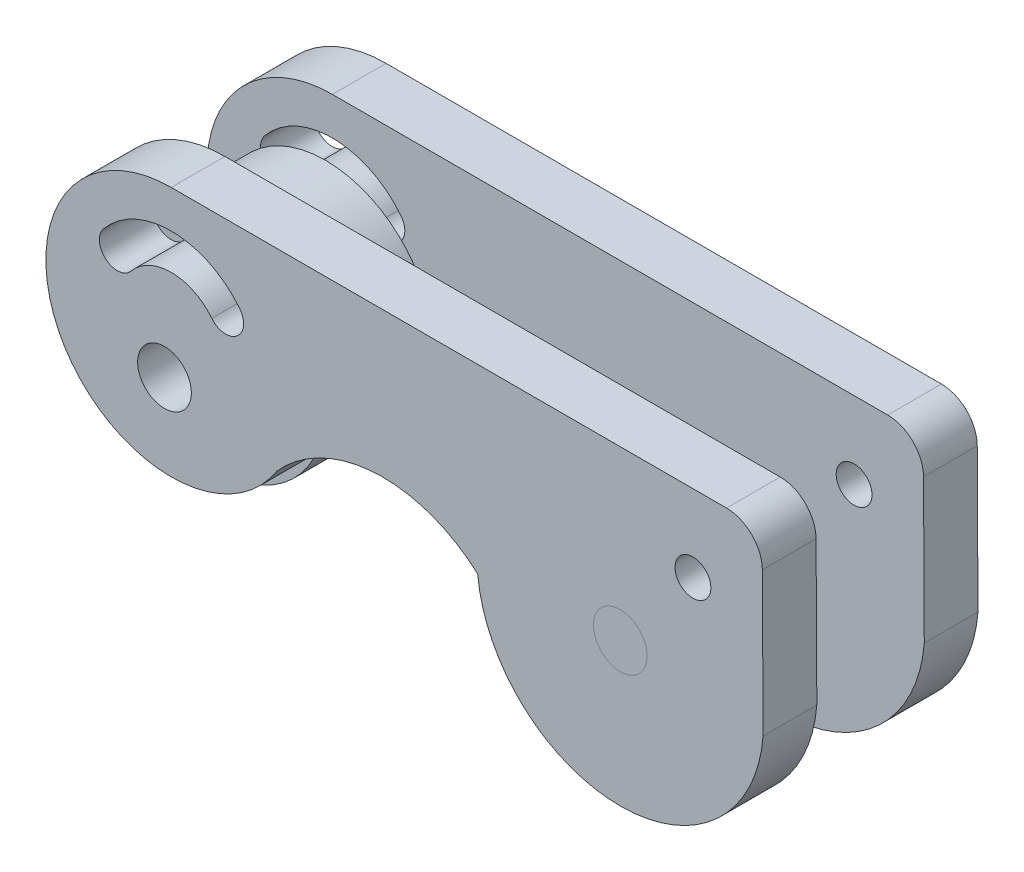
ISO-10303-21;
HEADER;
FILE_DESCRIPTION(('STEP AP214'),'2;1');
FILE_NAME('part.step','',(''),(''),'','','');
FILE_SCHEMA(('AUTOMOTIVE_DESIGN { 1 0 10303 214 1 1 1 1 }'));
ENDSEC;
DATA;
#1=APPLICATION_CONTEXT('core data for automotive mechanical design processes');
#2=APPLICATION_PROTOCOL_DEFINITION('international standard','automotive_design',2000,#1);
#3=PRODUCT_CONTEXT('',#1,'mechanical');
#4=PRODUCT('Part','Part','',(#3));
#5=PRODUCT_RELATED_PRODUCT_CATEGORY('part','',(#4));
#6=PRODUCT_DEFINITION_FORMATION('','',#4);
#7=PRODUCT_DEFINITION_CONTEXT('part definition',#1,'design');
#8=PRODUCT_DEFINITION('design','',#6,#7);
#9=PRODUCT_DEFINITION_SHAPE('','',#8);
#10=(LENGTH_UNIT() NAMED_UNIT(*) SI_UNIT(.MILLI.,.METRE.));
#11=(NAMED_UNIT(*) PLANE_ANGLE_UNIT() SI_UNIT($,.RADIAN.));
#12=(NAMED_UNIT(*) SI_UNIT($,.STERADIAN.) SOLID_ANGLE_UNIT());
#13=UNCERTAINTY_MEASURE_WITH_UNIT(LENGTH_MEASURE(1.E-05),#10,'distance_accuracy_value','');
#14=(GEOMETRIC_REPRESENTATION_CONTEXT(3) GLOBAL_UNCERTAINTY_ASSIGNED_CONTEXT((#13)) GLOBAL_UNIT_ASSIGNED_CONTEXT((#10,
#11,#12)) REPRESENTATION_CONTEXT('',''));
#15=CARTESIAN_POINT('',(0.,0.,0.));
#16=DIRECTION('',(0.,0.,1.));
#17=DIRECTION('',(1.,0.,0.));
#18=AXIS2_PLACEMENT_3D('',#15,#16,#17);
#19=CARTESIAN_POINT('',(8.75431331325364,33.2026229633381,-19.7857344309896));
#20=DIRECTION('',(0.,0.,-1.));
#21=DIRECTION('',(-1.,0.,0.));
#22=AXIS2_PLACEMENT_3D('',#19,#20,#21);
#23=CYLINDRICAL_SURFACE('',#22,1.5);
#24=CARTESIAN_POINT('',(8.75431331325364,33.2026229633381,-19.7857344309896));
#25=DIRECTION('',(0.,0.,1.));
#26=DIRECTION('',(1.,0.,0.));
#27=AXIS2_PLACEMENT_3D('',#24,#25,#26);
#28=CIRCLE('',#27,1.5);
#29=CARTESIAN_POINT('',(10.2543133132536,33.2026229633381,-19.7857344309896));
#30=VERTEX_POINT('',#29);
#31=EDGE_CURVE('P0_E10',#30,#30,#28,.T.);
#32=ORIENTED_EDGE('',*,*,#31,.F.);
#33=EDGE_LOOP('',(#32));
#34=FACE_BOUND('',#33,.T.);
#35=CARTESIAN_POINT('',(8.75431331325364,33.2026229633381,-31.7857344309896));
#36=DIRECTION('',(0.,0.,1.));
#37=DIRECTION('',(1.,0.,0.));
#38=AXIS2_PLACEMENT_3D('',#35,#36,#37);
#39=CIRCLE('',#38,1.5);
#40=CARTESIAN_POINT('',(10.2543133132536,33.2026229633381,-31.7857344309896));
#41=VERTEX_POINT('',#40);
#42=EDGE_CURVE('P0_E18',#41,#41,#39,.T.);
#43=ORIENTED_EDGE('',*,*,#42,.T.);
#44=EDGE_LOOP('',(#43));
#45=FACE_BOUND('',#44,.T.);
#46=ADVANCED_FACE('P0_F15',(#34,#45),#23,.T.);
#47=CARTESIAN_POINT('',(8.75431331325364,33.2026229633381,-19.7857344309896));
#48=DIRECTION('',(0.,0.,1.));
#49=DIRECTION('',(1.,0.,0.));
#50=AXIS2_PLACEMENT_3D('',#47,#48,#49);
#51=PLANE('',#50);
#52=ORIENTED_EDGE('',*,*,#31,.T.);
#53=EDGE_LOOP('',(#52));
#54=FACE_BOUND('',#53,.T.);
#55=ADVANCED_FACE('P0_F30',(#54),#51,.T.);
#56=CARTESIAN_POINT('',(8.75431331325364,33.2026229633381,-31.7857344309896));
#57=DIRECTION('',(0.,0.,1.));
#58=DIRECTION('',(1.,0.,0.));
#59=AXIS2_PLACEMENT_3D('',#56,#57,#58);
#60=PLANE('',#59);
#61=ORIENTED_EDGE('',*,*,#42,.F.);
#62=EDGE_LOOP('',(#61));
#63=FACE_BOUND('',#62,.T.);
#64=ADVANCED_FACE('P0_F28',(#63),#60,.F.);
#65=CLOSED_SHELL('',(#46,#55,#64));
#66=MANIFOLD_SOLID_BREP('P0_B1',#65);
#67=CARTESIAN_POINT('',(-16.6985633335867,33.2026229633381,-22.7857344309896));
#68=DIRECTION('',(0.,0.,1.));
#69=DIRECTION('',(-0.517788977415882,0.855508372177979,0.));
#70=AXIS2_PLACEMENT_3D('',#67,#68,#69);
#71=PLANE('',#70);
#72=CARTESIAN_POINT('',(-16.6985633335867,33.2026229633381,-22.7857344309896));
#73=DIRECTION('',(0.,0.,1.));
#74=DIRECTION('',(-0.517788977415882,0.855508372177979,0.));
#75=AXIS2_PLACEMENT_3D('',#72,#73,#74);
#76=CIRCLE('',#75,6.);
#77=CARTESIAN_POINT('',(-19.805297198082,38.335673196406,-22.7857344309896));
#78=VERTEX_POINT('',#77);
#79=EDGE_CURVE('P1_E9',#78,#78,#76,.T.);
#80=ORIENTED_EDGE('',*,*,#79,.T.);
#81=EDGE_LOOP('',(#80));
#82=FACE_BOUND('',#81,.T.);
#83=CARTESIAN_POINT('',(-16.6985633335867,33.2026229633381,-22.7857344309896));
#84=DIRECTION('',(0.,0.,1.));
#85=DIRECTION('',(-0.517788977415882,0.855508372177979,0.));
#86=AXIS2_PLACEMENT_3D('',#83,#84,#85);
#87=CIRCLE('',#86,1.5);
#88=CARTESIAN_POINT('',(-17.4752467997105,34.485885521605,-22.7857344309896));
#89=VERTEX_POINT('',#88);
#90=EDGE_CURVE('P1_E25',#89,#89,#87,.T.);
#91=ORIENTED_EDGE('',*,*,#90,.F.);
#92=EDGE_LOOP('',(#91));
#93=FACE_BOUND('',#92,.T.);
#94=ADVANCED_FACE('P1_F14',(#82,#93),#71,.T.);
#95=CARTESIAN_POINT('',(-16.6985633335867,33.2026229633381,-28.7857344309896));
#96=DIRECTION('',(0.,0.,1.));
#97=DIRECTION('',(-0.517788977415882,0.855508372177979,0.));
#98=AXIS2_PLACEMENT_3D('',#95,#96,#97);
#99=PLANE('',#98);
#100=CARTESIAN_POINT('',(-16.6985633335867,33.2026229633381,-28.7857344309896));
#101=DIRECTION('',(0.,0.,1.));
#102=DIRECTION('',(-0.517788977415882,0.855508372177979,0.));
#103=AXIS2_PLACEMENT_3D('',#100,#101,#102);
#104=CIRCLE('',#103,6.);
#105=CARTESIAN_POINT('',(-19.805297198082,38.335673196406,-28.7857344309896));
#106=VERTEX_POINT('',#105);
#107=EDGE_CURVE('P1_E18',#106,#106,#104,.T.);
#108=ORIENTED_EDGE('',*,*,#107,.F.);
#109=EDGE_LOOP('',(#108));
#110=FACE_BOUND('',#109,.T.);
#111=CARTESIAN_POINT('',(-16.6985633335867,33.2026229633381,-28.7857344309896));
#112=DIRECTION('',(0.,0.,1.));
#113=DIRECTION('',(-0.517788977415882,0.855508372177979,0.));
#114=AXIS2_PLACEMENT_3D('',#111,#112,#113);
#115=CIRCLE('',#114,1.5);
#116=CARTESIAN_POINT('',(-17.4752467997105,34.485885521605,-28.7857344309896));
#117=VERTEX_POINT('',#116);
#118=EDGE_CURVE('P1_E27',#117,#117,#115,.T.);
#119=ORIENTED_EDGE('',*,*,#118,.T.);
#120=EDGE_LOOP('',(#119));
#121=FACE_BOUND('',#120,.T.);
#122=ADVANCED_FACE('P1_F37',(#110,#121),#99,.F.);
#123=CARTESIAN_POINT('',(-16.6985633335867,33.2026229633381,-22.7857344309896));
#124=DIRECTION('',(0.,0.,-1.));
#125=DIRECTION('',(0.517788977415882,-0.855508372177979,0.));
#126=AXIS2_PLACEMENT_3D('',#123,#124,#125);
#127=CYLINDRICAL_SURFACE('',#126,6.);
#128=ORIENTED_EDGE('',*,*,#79,.F.);
#129=EDGE_LOOP('',(#128));
#130=FACE_BOUND('',#129,.T.);
#131=ORIENTED_EDGE('',*,*,#107,.T.);
#132=EDGE_LOOP('',(#131));
#133=FACE_BOUND('',#132,.T.);
#134=ADVANCED_FACE('P1_F16',(#130,#133),#127,.T.);
#135=CARTESIAN_POINT('',(-16.6985633335867,33.2026229633381,-22.7857344309896));
#136=DIRECTION('',(0.,0.,-1.));
#137=DIRECTION('',(0.517788977415882,-0.855508372177979,0.));
#138=AXIS2_PLACEMENT_3D('',#135,#136,#137);
#139=CYLINDRICAL_SURFACE('',#138,1.5);
#140=ORIENTED_EDGE('',*,*,#90,.T.);
#141=EDGE_LOOP('',(#140));
#142=FACE_BOUND('',#141,.T.);
#143=ORIENTED_EDGE('',*,*,#118,.F.);
#144=EDGE_LOOP('',(#143));
#145=FACE_BOUND('',#144,.T.);
#146=ADVANCED_FACE('P1_F33',(#142,#145),#139,.F.);
#147=CLOSED_SHELL('',(#94,#122,#134,#146));
#148=MANIFOLD_SOLID_BREP('P1_B1',#147);
#149=CARTESIAN_POINT('',(-16.3228165615196,35.5800352096352,-19.7857344309896));
#150=DIRECTION('',(0.,0.,1.));
#151=DIRECTION('',(1.,0.,0.));
#152=AXIS2_PLACEMENT_3D('',#149,#150,#151);
#153=PLANE('',#152);
#154=CARTESIAN_POINT('',(12.8113036584747,38.2810901867022,-19.7857344309896));
#155=DIRECTION('',(0.,0.,1.));
#156=DIRECTION('',(1.,0.,0.));
#157=AXIS2_PLACEMENT_3D('',#154,#155,#156);
#158=CIRCLE('',#157,1.);
#159=CARTESIAN_POINT('',(13.8113036584747,38.2810901867022,-19.7857344309896));
#160=VERTEX_POINT('',#159);
#161=EDGE_CURVE('P2_E123',#160,#160,#158,.T.);
#162=ORIENTED_EDGE('',*,*,#161,.F.);
#163=EDGE_LOOP('',(#162));
#164=FACE_BOUND('',#163,.T.);
#165=CARTESIAN_POINT('',(-16.3228165615196,35.5800352096352,-19.7857344309896));
#166=DIRECTION('',(0.,0.,1.));
#167=DIRECTION('',(1.,0.,0.));
#168=AXIS2_PLACEMENT_3D('',#165,#166,#167);
#169=CIRCLE('',#168,7.);
#170=CARTESIAN_POINT('',(-16.3228165615196,42.5800352096351,-19.7857344309896));
#171=VERTEX_POINT('',#170);
#172=CARTESIAN_POINT('',(-10.4277419329652,31.8053703074518,-19.7857344309896));
#173=VERTEX_POINT('',#172);
#174=EDGE_CURVE('P2_E139',#171,#173,#169,.T.);
#175=ORIENTED_EDGE('',*,*,#174,.T.);
#176=CARTESIAN_POINT('',(-4.50272099498319,26.5800352096352,-19.7857344309896));
#177=DIRECTION('',(0.,0.,-1.));
#178=DIRECTION('',(-1.,0.,0.));
#179=AXIS2_PLACEMENT_3D('',#176,#177,#178);
#180=CIRCLE('',#179,7.9);
#181=CARTESIAN_POINT('',(0.790300162154489,32.4446687898423,-19.7857344309896));
#182=VERTEX_POINT('',#181);
#183=EDGE_CURVE('P2_E142',#173,#182,#180,.T.);
#184=ORIENTED_EDGE('',*,*,#183,.T.);
#185=CARTESIAN_POINT('',(8.75431331325364,33.2026229633381,-19.7857344309896));
#186=DIRECTION('',(0.,0.,1.));
#187=DIRECTION('',(1.,0.,0.));
#188=AXIS2_PLACEMENT_3D('',#185,#186,#187);
#189=CIRCLE('',#188,8.);
#190=CARTESIAN_POINT('',(16.7297550170837,32.5762607448033,-19.7857344309896));
#191=VERTEX_POINT('',#190);
#192=EDGE_CURVE('P2_E145',#182,#191,#189,.T.);
#193=ORIENTED_EDGE('',*,*,#192,.T.);
#194=DIRECTION('',(-0.00525510174907032,0.999986191857471,0.));
#195=VECTOR('',#194,1.);
#196=CARTESIAN_POINT('',(16.7297550170837,32.5762607448033,-19.7857344309896));
#197=LINE('',#196,#195);
#198=CARTESIAN_POINT('',(16.6876385541555,40.5905454131333,-19.7857344309896));
#199=VERTEX_POINT('',#198);
#200=EDGE_CURVE('P2_E147',#191,#199,#197,.T.);
#201=ORIENTED_EDGE('',*,*,#200,.T.);
#202=CARTESIAN_POINT('',(14.6876661704406,40.5800352096351,-19.7857344309896));
#203=DIRECTION('',(0.,0.,1.));
#204=DIRECTION('',(-1.,0.,0.));
#205=AXIS2_PLACEMENT_3D('',#202,#203,#204);
#206=CIRCLE('',#205,2.);
#207=CARTESIAN_POINT('',(14.6876661704406,42.5800352096351,-19.7857344309896));
#208=VERTEX_POINT('',#207);
#209=EDGE_CURVE('P2_E149',#199,#208,#206,.T.);
#210=ORIENTED_EDGE('',*,*,#209,.T.);
#211=DIRECTION('',(-1.,0.,0.));
#212=VECTOR('',#211,1.);
#213=CARTESIAN_POINT('',(-16.3228165615196,42.5800352096351,-19.7857344309896));
#214=LINE('',#213,#212);
#215=EDGE_CURVE('P2_E151',#208,#171,#214,.T.);
#216=ORIENTED_EDGE('',*,*,#215,.T.);
#217=EDGE_LOOP('',(#175,#184,#193,#201,#210,#216));
#218=FACE_BOUND('',#217,.T.);
#219=CARTESIAN_POINT('',(8.75431331325364,33.2026229633381,-19.7857344309896));
#220=DIRECTION('',(0.,0.,1.));
#221=DIRECTION('',(1.,0.,0.));
#222=AXIS2_PLACEMENT_3D('',#219,#220,#221);
#223=CIRCLE('',#222,1.5);
#224=CARTESIAN_POINT('',(10.2543133132536,33.2026229633381,-19.7857344309896));
#225=VERTEX_POINT('',#224);
#226=EDGE_CURVE('P2_E133',#225,#225,#223,.T.);
#227=ORIENTED_EDGE('',*,*,#226,.F.);
#228=EDGE_LOOP('',(#227));
#229=FACE_BOUND('',#228,.T.);
#230=CARTESIAN_POINT('',(-16.3228165615196,35.5800352096352,-19.7857344309896));
#231=DIRECTION('',(0.,0.,1.));
#232=DIRECTION('',(1.,0.,0.));
#233=AXIS2_PLACEMENT_3D('',#230,#231,#232);
#234=CIRCLE('',#233,4.89513860802206);
#235=CARTESIAN_POINT('',(-12.4977183373552,38.6347046790284,-19.7857344309896));
#236=VERTEX_POINT('',#235);
#237=CARTESIAN_POINT('',(-20.1062034121941,38.6862170990118,-19.7857344309896));
#238=VERTEX_POINT('',#237);
#239=EDGE_CURVE('P2_E102',#236,#238,#234,.T.);
#240=ORIENTED_EDGE('',*,*,#239,.F.);
#241=CARTESIAN_POINT('',(-13.2791258786853,38.0106836422415,-19.7857344309896));
#242=DIRECTION('',(0.,0.,1.));
#243=DIRECTION('',(-1.,0.,0.));
#244=AXIS2_PLACEMENT_3D('',#241,#242,#243);
#245=CIRCLE('',#244,0.999999999999999);
#246=CARTESIAN_POINT('',(-14.0605334200153,37.3866626054547,-19.7857344309896));
#247=VERTEX_POINT('',#246);
#248=EDGE_CURVE('P2_E94',#247,#236,#245,.T.);
#249=ORIENTED_EDGE('',*,*,#248,.F.);
#250=CARTESIAN_POINT('',(-16.3228165615196,35.5800352096352,-19.7857344309896));
#251=DIRECTION('',(0.,0.,-1.));
#252=DIRECTION('',(1.,0.,0.));
#253=AXIS2_PLACEMENT_3D('',#250,#251,#252);
#254=CIRCLE('',#253,2.89513860802206);
#255=CARTESIAN_POINT('',(-18.5604302876193,37.417128667364,-19.7857344309896));
#256=VERTEX_POINT('',#255);
#257=EDGE_CURVE('P2_E117',#256,#247,#254,.T.);
#258=ORIENTED_EDGE('',*,*,#257,.F.);
#259=CARTESIAN_POINT('',(-19.3333168499067,38.0516728831879,-19.7857344309896));
#260=DIRECTION('',(0.,0.,1.));
#261=DIRECTION('',(1.,0.,0.));
#262=AXIS2_PLACEMENT_3D('',#259,#260,#261);
#263=CIRCLE('',#262,1.);
#264=EDGE_CURVE('P2_E115',#238,#256,#263,.T.);
#265=ORIENTED_EDGE('',*,*,#264,.F.);
#266=EDGE_LOOP('',(#240,#249,#258,#265));
#267=FACE_BOUND('',#266,.T.);
#268=CARTESIAN_POINT('',(-16.6985633335867,33.2026229633381,-19.7857344309896));
#269=DIRECTION('',(0.,0.,1.));
#270=DIRECTION('',(1.,0.,0.));
#271=AXIS2_PLACEMENT_3D('',#268,#269,#270);
#272=CIRCLE('',#271,1.5);
#273=CARTESIAN_POINT('',(-15.1985633335867,33.2026229633381,-19.7857344309896));
#274=VERTEX_POINT('',#273);
#275=EDGE_CURVE('P2_E252',#274,#274,#272,.T.);
#276=ORIENTED_EDGE('',*,*,#275,.F.);
#277=EDGE_LOOP('',(#276));
#278=FACE_BOUND('',#277,.T.);
#279=ADVANCED_FACE('P2_F17',(#164,#218,#229,#267,#278),#153,.T.);
#280=CARTESIAN_POINT('',(-16.3228165615196,35.5800352096352,-22.7857344309896));
#281=DIRECTION('',(0.,0.,1.));
#282=DIRECTION('',(1.,0.,0.));
#283=AXIS2_PLACEMENT_3D('',#280,#281,#282);
#284=PLANE('',#283);
#285=CARTESIAN_POINT('',(8.75431331325364,33.2026229633381,-22.7857344309896));
#286=DIRECTION('',(0.,0.,1.));
#287=DIRECTION('',(1.,0.,0.));
#288=AXIS2_PLACEMENT_3D('',#285,#286,#287);
#289=CIRCLE('',#288,1.5);
#290=CARTESIAN_POINT('',(10.2543133132536,33.2026229633381,-22.7857344309896));
#291=VERTEX_POINT('',#290);
#292=EDGE_CURVE('P2_E110',#291,#291,#289,.T.);
#293=ORIENTED_EDGE('',*,*,#292,.T.);
#294=EDGE_LOOP('',(#293));
#295=FACE_BOUND('',#294,.T.);
#296=CARTESIAN_POINT('',(-16.3228165615196,35.5800352096352,-22.7857344309896));
#297=DIRECTION('',(0.,0.,1.));
#298=DIRECTION('',(1.,0.,0.));
#299=AXIS2_PLACEMENT_3D('',#296,#297,#298);
#300=CIRCLE('',#299,7.);
#301=CARTESIAN_POINT('',(-16.3228165615196,42.5800352096351,-22.7857344309896));
#302=VERTEX_POINT('',#301);
#303=CARTESIAN_POINT('',(-10.4277419329652,31.8053703074518,-22.7857344309896));
#304=VERTEX_POINT('',#303);
#305=EDGE_CURVE('P2_E136',#302,#304,#300,.T.);
#306=ORIENTED_EDGE('',*,*,#305,.F.);
#307=DIRECTION('',(-1.,0.,0.));
#308=VECTOR('',#307,1.);
#309=CARTESIAN_POINT('',(-16.3228165615196,42.5800352096351,-22.7857344309896));
#310=LINE('',#309,#308);
#311=CARTESIAN_POINT('',(14.6876661704406,42.5800352096351,-22.7857344309896));
#312=VERTEX_POINT('',#311);
#313=EDGE_CURVE('P2_E143',#312,#302,#310,.T.);
#314=ORIENTED_EDGE('',*,*,#313,.F.);
#315=CARTESIAN_POINT('',(14.6876661704406,40.5800352096351,-22.7857344309896));
#316=DIRECTION('',(0.,0.,1.));
#317=DIRECTION('',(-1.,0.,0.));
#318=AXIS2_PLACEMENT_3D('',#315,#316,#317);
#319=CIRCLE('',#318,2.);
#320=CARTESIAN_POINT('',(16.6876385541555,40.5905454131333,-22.7857344309896));
#321=VERTEX_POINT('',#320);
#322=EDGE_CURVE('P2_E162',#321,#312,#319,.T.);
#323=ORIENTED_EDGE('',*,*,#322,.F.);
#324=DIRECTION('',(-0.00525510174907032,0.999986191857471,0.));
#325=VECTOR('',#324,1.);
#326=CARTESIAN_POINT('',(16.7297550170837,32.5762607448033,-22.7857344309896));
#327=LINE('',#326,#325);
#328=CARTESIAN_POINT('',(16.7297550170837,32.5762607448033,-22.7857344309896));
#329=VERTEX_POINT('',#328);
#330=EDGE_CURVE('P2_E160',#329,#321,#327,.T.);
#331=ORIENTED_EDGE('',*,*,#330,.F.);
#332=CARTESIAN_POINT('',(8.75431331325364,33.2026229633381,-22.7857344309896));
#333=DIRECTION('',(0.,0.,1.));
#334=DIRECTION('',(1.,0.,0.));
#335=AXIS2_PLACEMENT_3D('',#332,#333,#334);
#336=CIRCLE('',#335,8.);
#337=CARTESIAN_POINT('',(0.790300162154489,32.4446687898423,-22.7857344309896));
#338=VERTEX_POINT('',#337);
#339=EDGE_CURVE('P2_E158',#338,#329,#336,.T.);
#340=ORIENTED_EDGE('',*,*,#339,.F.);
#341=CARTESIAN_POINT('',(-4.50272099498319,26.5800352096352,-22.7857344309896));
#342=DIRECTION('',(0.,0.,-1.));
#343=DIRECTION('',(-1.,0.,0.));
#344=AXIS2_PLACEMENT_3D('',#341,#342,#343);
#345=CIRCLE('',#344,7.9);
#346=EDGE_CURVE('P2_E156',#304,#338,#345,.T.);
#347=ORIENTED_EDGE('',*,*,#346,.F.);
#348=EDGE_LOOP('',(#306,#314,#323,#331,#340,#347));
#349=FACE_BOUND('',#348,.T.);
#350=CARTESIAN_POINT('',(-13.2791258786853,38.0106836422415,-22.7857344309896));
#351=DIRECTION('',(0.,0.,1.));
#352=DIRECTION('',(-1.,0.,0.));
#353=AXIS2_PLACEMENT_3D('',#350,#351,#352);
#354=CIRCLE('',#353,0.999999999999999);
#355=CARTESIAN_POINT('',(-14.0605334200153,37.3866626054547,-22.7857344309896));
#356=VERTEX_POINT('',#355);
#357=CARTESIAN_POINT('',(-12.4977183373552,38.6347046790284,-22.7857344309896));
#358=VERTEX_POINT('',#357);
#359=EDGE_CURVE('P2_E40',#356,#358,#354,.T.);
#360=ORIENTED_EDGE('',*,*,#359,.T.);
#361=CARTESIAN_POINT('',(-16.3228165615196,35.5800352096352,-22.7857344309896));
#362=DIRECTION('',(0.,0.,1.));
#363=DIRECTION('',(1.,0.,0.));
#364=AXIS2_PLACEMENT_3D('',#361,#362,#363);
#365=CIRCLE('',#364,4.89513860802206);
#366=CARTESIAN_POINT('',(-20.1062034121941,38.6862170990118,-22.7857344309896));
#367=VERTEX_POINT('',#366);
#368=EDGE_CURVE('P2_E109',#358,#367,#365,.T.);
#369=ORIENTED_EDGE('',*,*,#368,.T.);
#370=CARTESIAN_POINT('',(-19.3333168499067,38.0516728831879,-22.7857344309896));
#371=DIRECTION('',(0.,0.,1.));
#372=DIRECTION('',(1.,0.,0.));
#373=AXIS2_PLACEMENT_3D('',#370,#371,#372);
#374=CIRCLE('',#373,1.);
#375=CARTESIAN_POINT('',(-18.5604302876193,37.417128667364,-22.7857344309896));
#376=VERTEX_POINT('',#375);
#377=EDGE_CURVE('P2_E125',#367,#376,#374,.T.);
#378=ORIENTED_EDGE('',*,*,#377,.T.);
#379=CARTESIAN_POINT('',(-16.3228165615196,35.5800352096352,-22.7857344309896));
#380=DIRECTION('',(0.,0.,-1.));
#381=DIRECTION('',(1.,0.,0.));
#382=AXIS2_PLACEMENT_3D('',#379,#380,#381);
#383=CIRCLE('',#382,2.89513860802206);
#384=EDGE_CURVE('P2_E103',#376,#356,#383,.T.);
#385=ORIENTED_EDGE('',*,*,#384,.T.);
#386=EDGE_LOOP('',(#360,#369,#378,#385));
#387=FACE_BOUND('',#386,.T.);
#388=CARTESIAN_POINT('',(12.8113036584747,38.2810901867022,-22.7857344309896));
#389=DIRECTION('',(0.,0.,1.));
#390=DIRECTION('',(1.,0.,0.));
#391=AXIS2_PLACEMENT_3D('',#388,#389,#390);
#392=CIRCLE('',#391,1.);
#393=CARTESIAN_POINT('',(13.8113036584747,38.2810901867022,-22.7857344309896));
#394=VERTEX_POINT('',#393);
#395=EDGE_CURVE('P2_E258',#394,#394,#392,.T.);
#396=ORIENTED_EDGE('',*,*,#395,.T.);
#397=EDGE_LOOP('',(#396));
#398=FACE_BOUND('',#397,.T.);
#399=CARTESIAN_POINT('',(-16.6985633335867,33.2026229633381,-22.7857344309896));
#400=DIRECTION('',(0.,0.,1.));
#401=DIRECTION('',(1.,0.,0.));
#402=AXIS2_PLACEMENT_3D('',#399,#400,#401);
#403=CIRCLE('',#402,1.5);
#404=CARTESIAN_POINT('',(-15.1985633335867,33.2026229633381,-22.7857344309896));
#405=VERTEX_POINT('',#404);
#406=EDGE_CURVE('P2_E255',#405,#405,#403,.T.);
#407=ORIENTED_EDGE('',*,*,#406,.T.);
#408=EDGE_LOOP('',(#407));
#409=FACE_BOUND('',#408,.T.);
#410=ADVANCED_FACE('P2_F186',(#295,#349,#387,#398,#409),#284,.F.);
#411=CARTESIAN_POINT('',(-16.3228165615196,35.5800352096352,-19.7857344309896));
#412=DIRECTION('',(0.,0.,-1.));
#413=DIRECTION('',(-1.,0.,0.));
#414=AXIS2_PLACEMENT_3D('',#411,#412,#413);
#415=CYLINDRICAL_SURFACE('',#414,7.);
#416=ORIENTED_EDGE('',*,*,#305,.T.);
#417=DIRECTION('',(0.,0.,-1.));
#418=VECTOR('',#417,1.);
#419=CARTESIAN_POINT('',(-10.4277419329652,31.8053703074518,-19.7857344309896));
#420=LINE('',#419,#418);
#421=EDGE_CURVE('P2_E11',#173,#304,#420,.T.);
#422=ORIENTED_EDGE('',*,*,#421,.F.);
#423=ORIENTED_EDGE('',*,*,#174,.F.);
#424=DIRECTION('',(0.,0.,-1.));
#425=VECTOR('',#424,1.);
#426=CARTESIAN_POINT('',(-16.3228165615196,42.5800352096351,-19.7857344309896));
#427=LINE('',#426,#425);
#428=EDGE_CURVE('P2_E153',#171,#302,#427,.T.);
#429=ORIENTED_EDGE('',*,*,#428,.T.);
#430=EDGE_LOOP('',(#416,#422,#423,#429));
#431=FACE_BOUND('',#430,.T.);
#432=ADVANCED_FACE('P2_F19',(#431),#415,.T.);
#433=CARTESIAN_POINT('',(-4.50272099498319,26.5800352096352,-19.7857344309896));
#434=DIRECTION('',(0.,0.,-1.));
#435=DIRECTION('',(-1.,0.,0.));
#436=AXIS2_PLACEMENT_3D('',#433,#434,#435);
#437=CYLINDRICAL_SURFACE('',#436,7.9);
#438=ORIENTED_EDGE('',*,*,#346,.T.);
#439=DIRECTION('',(0.,0.,-1.));
#440=VECTOR('',#439,1.);
#441=CARTESIAN_POINT('',(0.790300162154489,32.4446687898423,-19.7857344309896));
#442=LINE('',#441,#440);
#443=EDGE_CURVE('P2_E25',#182,#338,#442,.T.);
#444=ORIENTED_EDGE('',*,*,#443,.F.);
#445=ORIENTED_EDGE('',*,*,#183,.F.);
#446=ORIENTED_EDGE('',*,*,#421,.T.);
#447=EDGE_LOOP('',(#438,#444,#445,#446));
#448=FACE_BOUND('',#447,.T.);
#449=ADVANCED_FACE('P2_F204',(#448),#437,.F.);
#450=CARTESIAN_POINT('',(8.75431331325364,33.2026229633381,-19.7857344309896));
#451=DIRECTION('',(0.,0.,-1.));
#452=DIRECTION('',(-1.,0.,0.));
#453=AXIS2_PLACEMENT_3D('',#450,#451,#452);
#454=CYLINDRICAL_SURFACE('',#453,8.);
#455=ORIENTED_EDGE('',*,*,#339,.T.);
#456=DIRECTION('',(0.,0.,-1.));
#457=VECTOR('',#456,1.);
#458=CARTESIAN_POINT('',(16.7297550170837,32.5762607448033,-19.7857344309896));
#459=LINE('',#458,#457);
#460=EDGE_CURVE('P2_E173',#191,#329,#459,.T.);
#461=ORIENTED_EDGE('',*,*,#460,.F.);
#462=ORIENTED_EDGE('',*,*,#192,.F.);
#463=ORIENTED_EDGE('',*,*,#443,.T.);
#464=EDGE_LOOP('',(#455,#461,#462,#463));
#465=FACE_BOUND('',#464,.T.);
#466=ADVANCED_FACE('P2_F180',(#465),#454,.T.);
#467=CARTESIAN_POINT('',(16.7297550170837,32.5762607448033,-19.7857344309896));
#468=DIRECTION('',(-0.999986191857471,-0.00525510174907032,0.));
#469=DIRECTION('',(0.00525510174907032,-0.999986191857471,0.));
#470=AXIS2_PLACEMENT_3D('',#467,#468,#469);
#471=PLANE('',#470);
#472=ORIENTED_EDGE('',*,*,#330,.T.);
#473=DIRECTION('',(0.,0.,-1.));
#474=VECTOR('',#473,1.);
#475=CARTESIAN_POINT('',(16.6876385541555,40.5905454131333,-19.7857344309896));
#476=LINE('',#475,#474);
#477=EDGE_CURVE('P2_E170',#199,#321,#476,.T.);
#478=ORIENTED_EDGE('',*,*,#477,.F.);
#479=ORIENTED_EDGE('',*,*,#200,.F.);
#480=ORIENTED_EDGE('',*,*,#460,.T.);
#481=EDGE_LOOP('',(#472,#478,#479,#480));
#482=FACE_BOUND('',#481,.T.);
#483=ADVANCED_FACE('P2_F192',(#482),#471,.F.);
#484=CARTESIAN_POINT('',(14.6876661704406,40.5800352096351,-19.7857344309896));
#485=DIRECTION('',(0.,0.,-1.));
#486=DIRECTION('',(-1.,0.,0.));
#487=AXIS2_PLACEMENT_3D('',#484,#485,#486);
#488=CYLINDRICAL_SURFACE('',#487,2.);
#489=ORIENTED_EDGE('',*,*,#322,.T.);
#490=DIRECTION('',(0.,0.,-1.));
#491=VECTOR('',#490,1.);
#492=CARTESIAN_POINT('',(14.6876661704406,42.5800352096351,-19.7857344309896));
#493=LINE('',#492,#491);
#494=EDGE_CURVE('P2_E167',#208,#312,#493,.T.);
#495=ORIENTED_EDGE('',*,*,#494,.F.);
#496=ORIENTED_EDGE('',*,*,#209,.F.);
#497=ORIENTED_EDGE('',*,*,#477,.T.);
#498=EDGE_LOOP('',(#489,#495,#496,#497));
#499=FACE_BOUND('',#498,.T.);
#500=ADVANCED_FACE('P2_F196',(#499),#488,.T.);
#501=CARTESIAN_POINT('',(-16.3228165615196,42.5800352096351,-19.7857344309896));
#502=DIRECTION('',(0.,-1.,0.));
#503=DIRECTION('',(0.,0.,-1.));
#504=AXIS2_PLACEMENT_3D('',#501,#502,#503);
#505=PLANE('',#504);
#506=ORIENTED_EDGE('',*,*,#313,.T.);
#507=ORIENTED_EDGE('',*,*,#428,.F.);
#508=ORIENTED_EDGE('',*,*,#215,.F.);
#509=ORIENTED_EDGE('',*,*,#494,.T.);
#510=EDGE_LOOP('',(#506,#507,#508,#509));
#511=FACE_BOUND('',#510,.T.);
#512=ADVANCED_FACE('P2_F207',(#511),#505,.F.);
#513=CARTESIAN_POINT('',(8.75431331325364,33.2026229633381,-19.7857344309896));
#514=DIRECTION('',(0.,0.,-1.));
#515=DIRECTION('',(-1.,0.,0.));
#516=AXIS2_PLACEMENT_3D('',#513,#514,#515);
#517=CYLINDRICAL_SURFACE('',#516,1.5);
#518=ORIENTED_EDGE('',*,*,#226,.T.);
#519=EDGE_LOOP('',(#518));
#520=FACE_BOUND('',#519,.T.);
#521=ORIENTED_EDGE('',*,*,#292,.F.);
#522=EDGE_LOOP('',(#521));
#523=FACE_BOUND('',#522,.T.);
#524=ADVANCED_FACE('P2_F209',(#520,#523),#517,.F.);
#525=CARTESIAN_POINT('',(-13.2791258786853,38.0106836422415,-19.7857344309896));
#526=DIRECTION('',(0.,0.,-1.));
#527=DIRECTION('',(-1.,0.,0.));
#528=AXIS2_PLACEMENT_3D('',#525,#526,#527);
#529=CYLINDRICAL_SURFACE('',#528,0.999999999999999);
#530=ORIENTED_EDGE('',*,*,#359,.F.);
#531=DIRECTION('',(0.,0.,-1.));
#532=VECTOR('',#531,1.);
#533=CARTESIAN_POINT('',(-14.0605334200153,37.3866626054547,-19.7857344309896));
#534=LINE('',#533,#532);
#535=EDGE_CURVE('P2_E98',#247,#356,#534,.T.);
#536=ORIENTED_EDGE('',*,*,#535,.F.);
#537=ORIENTED_EDGE('',*,*,#248,.T.);
#538=DIRECTION('',(0.,0.,-1.));
#539=VECTOR('',#538,1.);
#540=CARTESIAN_POINT('',(-12.4977183373552,38.6347046790284,-19.7857344309896));
#541=LINE('',#540,#539);
#542=EDGE_CURVE('P2_E97',#236,#358,#541,.T.);
#543=ORIENTED_EDGE('',*,*,#542,.T.);
#544=EDGE_LOOP('',(#530,#536,#537,#543));
#545=FACE_BOUND('',#544,.T.);
#546=ADVANCED_FACE('P2_F96',(#545),#529,.F.);
#547=CARTESIAN_POINT('',(-16.3228165615196,35.5800352096352,-19.7857344309896));
#548=DIRECTION('',(0.,0.,-1.));
#549=DIRECTION('',(-1.,0.,0.));
#550=AXIS2_PLACEMENT_3D('',#547,#548,#549);
#551=CYLINDRICAL_SURFACE('',#550,4.89513860802206);
#552=ORIENTED_EDGE('',*,*,#368,.F.);
#553=ORIENTED_EDGE('',*,*,#542,.F.);
#554=ORIENTED_EDGE('',*,*,#239,.T.);
#555=DIRECTION('',(0.,0.,-1.));
#556=VECTOR('',#555,1.);
#557=CARTESIAN_POINT('',(-20.1062034121941,38.6862170990118,-19.7857344309896));
#558=LINE('',#557,#556);
#559=EDGE_CURVE('P2_E111',#238,#367,#558,.T.);
#560=ORIENTED_EDGE('',*,*,#559,.T.);
#561=EDGE_LOOP('',(#552,#553,#554,#560));
#562=FACE_BOUND('',#561,.T.);
#563=ADVANCED_FACE('P2_F106',(#562),#551,.F.);
#564=CARTESIAN_POINT('',(-19.3333168499067,38.0516728831879,-19.7857344309896));
#565=DIRECTION('',(0.,0.,-1.));
#566=DIRECTION('',(-1.,0.,0.));
#567=AXIS2_PLACEMENT_3D('',#564,#565,#566);
#568=CYLINDRICAL_SURFACE('',#567,1.);
#569=ORIENTED_EDGE('',*,*,#377,.F.);
#570=ORIENTED_EDGE('',*,*,#559,.F.);
#571=ORIENTED_EDGE('',*,*,#264,.T.);
#572=DIRECTION('',(0.,0.,-1.));
#573=VECTOR('',#572,1.);
#574=CARTESIAN_POINT('',(-18.5604302876193,37.417128667364,-19.7857344309896));
#575=LINE('',#574,#573);
#576=EDGE_CURVE('P2_E32',#256,#376,#575,.T.);
#577=ORIENTED_EDGE('',*,*,#576,.T.);
#578=EDGE_LOOP('',(#569,#570,#571,#577));
#579=FACE_BOUND('',#578,.T.);
#580=ADVANCED_FACE('P2_F233',(#579),#568,.F.);
#581=CARTESIAN_POINT('',(-16.3228165615196,35.5800352096352,-19.7857344309896));
#582=DIRECTION('',(0.,0.,-1.));
#583=DIRECTION('',(-1.,0.,0.));
#584=AXIS2_PLACEMENT_3D('',#581,#582,#583);
#585=CYLINDRICAL_SURFACE('',#584,2.89513860802206);
#586=ORIENTED_EDGE('',*,*,#384,.F.);
#587=ORIENTED_EDGE('',*,*,#576,.F.);
#588=ORIENTED_EDGE('',*,*,#257,.T.);
#589=ORIENTED_EDGE('',*,*,#535,.T.);
#590=EDGE_LOOP('',(#586,#587,#588,#589));
#591=FACE_BOUND('',#590,.T.);
#592=ADVANCED_FACE('P2_F236',(#591),#585,.T.);
#593=CARTESIAN_POINT('',(12.8113036584747,38.2810901867022,-19.7857344309896));
#594=DIRECTION('',(0.,0.,-1.));
#595=DIRECTION('',(-1.,0.,0.));
#596=AXIS2_PLACEMENT_3D('',#593,#594,#595);
#597=CYLINDRICAL_SURFACE('',#596,1.);
#598=ORIENTED_EDGE('',*,*,#161,.T.);
#599=EDGE_LOOP('',(#598));
#600=FACE_BOUND('',#599,.T.);
#601=ORIENTED_EDGE('',*,*,#395,.F.);
#602=EDGE_LOOP('',(#601));
#603=FACE_BOUND('',#602,.T.);
#604=ADVANCED_FACE('P2_F240',(#600,#603),#597,.F.);
#605=CARTESIAN_POINT('',(-16.6985633335867,33.2026229633381,-19.7857344309896));
#606=DIRECTION('',(0.,0.,-1.));
#607=DIRECTION('',(-1.,0.,0.));
#608=AXIS2_PLACEMENT_3D('',#605,#606,#607);
#609=CYLINDRICAL_SURFACE('',#608,1.5);
#610=ORIENTED_EDGE('',*,*,#275,.T.);
#611=EDGE_LOOP('',(#610));
#612=FACE_BOUND('',#611,.T.);
#613=ORIENTED_EDGE('',*,*,#406,.F.);
#614=EDGE_LOOP('',(#613));
#615=FACE_BOUND('',#614,.T.);
#616=ADVANCED_FACE('P2_F243',(#612,#615),#609,.F.);
#617=CLOSED_SHELL('',(#279,#410,#432,#449,#466,#483,#500,#512,#524,#546,#563,#580,#592,#604,#616));
#618=MANIFOLD_SOLID_BREP('P2_B1',#617);
#619=CARTESIAN_POINT('',(-16.3228165615196,35.5800352096352,-28.7857344309896));
#620=DIRECTION('',(0.,0.,1.));
#621=DIRECTION('',(1.,0.,0.));
#622=AXIS2_PLACEMENT_3D('',#619,#620,#621);
#623=PLANE('',#622);
#624=CARTESIAN_POINT('',(12.8113036584747,38.2810901867022,-28.7857344309896));
#625=DIRECTION('',(0.,0.,1.));
#626=DIRECTION('',(1.,0.,0.));
#627=AXIS2_PLACEMENT_3D('',#624,#625,#626);
#628=CIRCLE('',#627,1.);
#629=CARTESIAN_POINT('',(13.8113036584747,38.2810901867022,-28.7857344309896));
#630=VERTEX_POINT('',#629);
#631=EDGE_CURVE('P3_E123',#630,#630,#628,.T.);
#632=ORIENTED_EDGE('',*,*,#631,.F.);
#633=EDGE_LOOP('',(#632));
#634=FACE_BOUND('',#633,.T.);
#635=CARTESIAN_POINT('',(-16.3228165615196,35.5800352096352,-28.7857344309896));
#636=DIRECTION('',(0.,0.,1.));
#637=DIRECTION('',(1.,0.,0.));
#638=AXIS2_PLACEMENT_3D('',#635,#636,#637);
#639=CIRCLE('',#638,7.);
#640=CARTESIAN_POINT('',(-16.3228165615196,42.5800352096351,-28.7857344309896));
#641=VERTEX_POINT('',#640);
#642=CARTESIAN_POINT('',(-10.4277419329652,31.8053703074518,-28.7857344309896));
#643=VERTEX_POINT('',#642);
#644=EDGE_CURVE('P3_E139',#641,#643,#639,.T.);
#645=ORIENTED_EDGE('',*,*,#644,.T.);
#646=CARTESIAN_POINT('',(-4.50272099498319,26.5800352096352,-28.7857344309896));
#647=DIRECTION('',(0.,0.,-1.));
#648=DIRECTION('',(-1.,0.,0.));
#649=AXIS2_PLACEMENT_3D('',#646,#647,#648);
#650=CIRCLE('',#649,7.9);
#651=CARTESIAN_POINT('',(0.790300162154489,32.4446687898423,-28.7857344309896));
#652=VERTEX_POINT('',#651);
#653=EDGE_CURVE('P3_E142',#643,#652,#650,.T.);
#654=ORIENTED_EDGE('',*,*,#653,.T.);
#655=CARTESIAN_POINT('',(8.75431331325364,33.2026229633381,-28.7857344309896));
#656=DIRECTION('',(0.,0.,1.));
#657=DIRECTION('',(1.,0.,0.));
#658=AXIS2_PLACEMENT_3D('',#655,#656,#657);
#659=CIRCLE('',#658,8.);
#660=CARTESIAN_POINT('',(16.7297550170837,32.5762607448033,-28.7857344309896));
#661=VERTEX_POINT('',#660);
#662=EDGE_CURVE('P3_E145',#652,#661,#659,.T.);
#663=ORIENTED_EDGE('',*,*,#662,.T.);
#664=DIRECTION('',(-0.00525510174907032,0.999986191857471,0.));
#665=VECTOR('',#664,1.);
#666=CARTESIAN_POINT('',(16.7297550170837,32.5762607448033,-28.7857344309896));
#667=LINE('',#666,#665);
#668=CARTESIAN_POINT('',(16.6876385541555,40.5905454131333,-28.7857344309896));
#669=VERTEX_POINT('',#668);
#670=EDGE_CURVE('P3_E147',#661,#669,#667,.T.);
#671=ORIENTED_EDGE('',*,*,#670,.T.);
#672=CARTESIAN_POINT('',(14.6876661704406,40.5800352096351,-28.7857344309896));
#673=DIRECTION('',(0.,0.,1.));
#674=DIRECTION('',(-1.,0.,0.));
#675=AXIS2_PLACEMENT_3D('',#672,#673,#674);
#676=CIRCLE('',#675,2.);
#677=CARTESIAN_POINT('',(14.6876661704406,42.5800352096351,-28.7857344309896));
#678=VERTEX_POINT('',#677);
#679=EDGE_CURVE('P3_E149',#669,#678,#676,.T.);
#680=ORIENTED_EDGE('',*,*,#679,.T.);
#681=DIRECTION('',(-1.,0.,0.));
#682=VECTOR('',#681,1.);
#683=CARTESIAN_POINT('',(-16.3228165615196,42.5800352096351,-28.7857344309896));
#684=LINE('',#683,#682);
#685=EDGE_CURVE('P3_E151',#678,#641,#684,.T.);
#686=ORIENTED_EDGE('',*,*,#685,.T.);
#687=EDGE_LOOP('',(#645,#654,#663,#671,#680,#686));
#688=FACE_BOUND('',#687,.T.);
#689=CARTESIAN_POINT('',(8.75431331325364,33.2026229633381,-28.7857344309896));
#690=DIRECTION('',(0.,0.,1.));
#691=DIRECTION('',(1.,0.,0.));
#692=AXIS2_PLACEMENT_3D('',#689,#690,#691);
#693=CIRCLE('',#692,1.5);
#694=CARTESIAN_POINT('',(10.2543133132536,33.2026229633381,-28.7857344309896));
#695=VERTEX_POINT('',#694);
#696=EDGE_CURVE('P3_E133',#695,#695,#693,.T.);
#697=ORIENTED_EDGE('',*,*,#696,.F.);
#698=EDGE_LOOP('',(#697));
#699=FACE_BOUND('',#698,.T.);
#700=CARTESIAN_POINT('',(-16.3228165615196,35.5800352096352,-28.7857344309896));
#701=DIRECTION('',(0.,0.,1.));
#702=DIRECTION('',(1.,0.,0.));
#703=AXIS2_PLACEMENT_3D('',#700,#701,#702);
#704=CIRCLE('',#703,4.89513860802206);
#705=CARTESIAN_POINT('',(-12.4977183373552,38.6347046790284,-28.7857344309896));
#706=VERTEX_POINT('',#705);
#707=CARTESIAN_POINT('',(-20.1062034121941,38.6862170990118,-28.7857344309896));
#708=VERTEX_POINT('',#707);
#709=EDGE_CURVE('P3_E102',#706,#708,#704,.T.);
#710=ORIENTED_EDGE('',*,*,#709,.F.);
#711=CARTESIAN_POINT('',(-13.2791258786853,38.0106836422415,-28.7857344309896));
#712=DIRECTION('',(0.,0.,1.));
#713=DIRECTION('',(-1.,0.,0.));
#714=AXIS2_PLACEMENT_3D('',#711,#712,#713);
#715=CIRCLE('',#714,0.999999999999999);
#716=CARTESIAN_POINT('',(-14.0605334200153,37.3866626054547,-28.7857344309896));
#717=VERTEX_POINT('',#716);
#718=EDGE_CURVE('P3_E94',#717,#706,#715,.T.);
#719=ORIENTED_EDGE('',*,*,#718,.F.);
#720=CARTESIAN_POINT('',(-16.3228165615196,35.5800352096352,-28.7857344309896));
#721=DIRECTION('',(0.,0.,-1.));
#722=DIRECTION('',(1.,0.,0.));
#723=AXIS2_PLACEMENT_3D('',#720,#721,#722);
#724=CIRCLE('',#723,2.89513860802206);
#725=CARTESIAN_POINT('',(-18.5604302876193,37.417128667364,-28.7857344309896));
#726=VERTEX_POINT('',#725);
#727=EDGE_CURVE('P3_E117',#726,#717,#724,.T.);
#728=ORIENTED_EDGE('',*,*,#727,.F.);
#729=CARTESIAN_POINT('',(-19.3333168499067,38.0516728831879,-28.7857344309896));
#730=DIRECTION('',(0.,0.,1.));
#731=DIRECTION('',(1.,0.,0.));
#732=AXIS2_PLACEMENT_3D('',#729,#730,#731);
#733=CIRCLE('',#732,1.);
#734=EDGE_CURVE('P3_E115',#708,#726,#733,.T.);
#735=ORIENTED_EDGE('',*,*,#734,.F.);
#736=EDGE_LOOP('',(#710,#719,#728,#735));
#737=FACE_BOUND('',#736,.T.);
#738=CARTESIAN_POINT('',(-16.6985633335867,33.2026229633381,-28.7857344309896));
#739=DIRECTION('',(0.,0.,1.));
#740=DIRECTION('',(1.,0.,0.));
#741=AXIS2_PLACEMENT_3D('',#738,#739,#740);
#742=CIRCLE('',#741,1.5);
#743=CARTESIAN_POINT('',(-15.1985633335867,33.2026229633381,-28.7857344309896));
#744=VERTEX_POINT('',#743);
#745=EDGE_CURVE('P3_E252',#744,#744,#742,.T.);
#746=ORIENTED_EDGE('',*,*,#745,.F.);
#747=EDGE_LOOP('',(#746));
#748=FACE_BOUND('',#747,.T.);
#749=ADVANCED_FACE('P3_F17',(#634,#688,#699,#737,#748),#623,.T.);
#750=CARTESIAN_POINT('',(-16.3228165615196,35.5800352096352,-31.7857344309896));
#751=DIRECTION('',(0.,0.,1.));
#752=DIRECTION('',(1.,0.,0.));
#753=AXIS2_PLACEMENT_3D('',#750,#751,#752);
#754=PLANE('',#753);
#755=CARTESIAN_POINT('',(8.75431331325364,33.2026229633381,-31.7857344309896));
#756=DIRECTION('',(0.,0.,1.));
#757=DIRECTION('',(1.,0.,0.));
#758=AXIS2_PLACEMENT_3D('',#755,#756,#757);
#759=CIRCLE('',#758,1.5);
#760=CARTESIAN_POINT('',(10.2543133132536,33.2026229633381,-31.7857344309896));
#761=VERTEX_POINT('',#760);
#762=EDGE_CURVE('P3_E110',#761,#761,#759,.T.);
#763=ORIENTED_EDGE('',*,*,#762,.T.);
#764=EDGE_LOOP('',(#763));
#765=FACE_BOUND('',#764,.T.);
#766=CARTESIAN_POINT('',(-16.3228165615196,35.5800352096352,-31.7857344309896));
#767=DIRECTION('',(0.,0.,1.));
#768=DIRECTION('',(1.,0.,0.));
#769=AXIS2_PLACEMENT_3D('',#766,#767,#768);
#770=CIRCLE('',#769,7.);
#771=CARTESIAN_POINT('',(-16.3228165615196,42.5800352096351,-31.7857344309896));
#772=VERTEX_POINT('',#771);
#773=CARTESIAN_POINT('',(-10.4277419329652,31.8053703074518,-31.7857344309896));
#774=VERTEX_POINT('',#773);
#775=EDGE_CURVE('P3_E136',#772,#774,#770,.T.);
#776=ORIENTED_EDGE('',*,*,#775,.F.);
#777=DIRECTION('',(-1.,0.,0.));
#778=VECTOR('',#777,1.);
#779=CARTESIAN_POINT('',(-16.3228165615196,42.5800352096351,-31.7857344309896));
#780=LINE('',#779,#778);
#781=CARTESIAN_POINT('',(14.6876661704406,42.5800352096351,-31.7857344309896));
#782=VERTEX_POINT('',#781);
#783=EDGE_CURVE('P3_E143',#782,#772,#780,.T.);
#784=ORIENTED_EDGE('',*,*,#783,.F.);
#785=CARTESIAN_POINT('',(14.6876661704406,40.5800352096351,-31.7857344309896));
#786=DIRECTION('',(0.,0.,1.));
#787=DIRECTION('',(-1.,0.,0.));
#788=AXIS2_PLACEMENT_3D('',#785,#786,#787);
#789=CIRCLE('',#788,2.);
#790=CARTESIAN_POINT('',(16.6876385541555,40.5905454131333,-31.7857344309896));
#791=VERTEX_POINT('',#790);
#792=EDGE_CURVE('P3_E162',#791,#782,#789,.T.);
#793=ORIENTED_EDGE('',*,*,#792,.F.);
#794=DIRECTION('',(-0.00525510174907032,0.999986191857471,0.));
#795=VECTOR('',#794,1.);
#796=CARTESIAN_POINT('',(16.7297550170837,32.5762607448033,-31.7857344309896));
#797=LINE('',#796,#795);
#798=CARTESIAN_POINT('',(16.7297550170837,32.5762607448033,-31.7857344309896));
#799=VERTEX_POINT('',#798);
#800=EDGE_CURVE('P3_E160',#799,#791,#797,.T.);
#801=ORIENTED_EDGE('',*,*,#800,.F.);
#802=CARTESIAN_POINT('',(8.75431331325364,33.2026229633381,-31.7857344309896));
#803=DIRECTION('',(0.,0.,1.));
#804=DIRECTION('',(1.,0.,0.));
#805=AXIS2_PLACEMENT_3D('',#802,#803,#804);
#806=CIRCLE('',#805,8.);
#807=CARTESIAN_POINT('',(0.790300162154489,32.4446687898423,-31.7857344309896));
#808=VERTEX_POINT('',#807);
#809=EDGE_CURVE('P3_E158',#808,#799,#806,.T.);
#810=ORIENTED_EDGE('',*,*,#809,.F.);
#811=CARTESIAN_POINT('',(-4.50272099498319,26.5800352096352,-31.7857344309896));
#812=DIRECTION('',(0.,0.,-1.));
#813=DIRECTION('',(-1.,0.,0.));
#814=AXIS2_PLACEMENT_3D('',#811,#812,#813);
#815=CIRCLE('',#814,7.9);
#816=EDGE_CURVE('P3_E156',#774,#808,#815,.T.);
#817=ORIENTED_EDGE('',*,*,#816,.F.);
#818=EDGE_LOOP('',(#776,#784,#793,#801,#810,#817));
#819=FACE_BOUND('',#818,.T.);
#820=CARTESIAN_POINT('',(-13.2791258786853,38.0106836422415,-31.7857344309896));
#821=DIRECTION('',(0.,0.,1.));
#822=DIRECTION('',(-1.,0.,0.));
#823=AXIS2_PLACEMENT_3D('',#820,#821,#822);
#824=CIRCLE('',#823,0.999999999999999);
#825=CARTESIAN_POINT('',(-14.0605334200153,37.3866626054547,-31.7857344309896));
#826=VERTEX_POINT('',#825);
#827=CARTESIAN_POINT('',(-12.4977183373552,38.6347046790284,-31.7857344309896));
#828=VERTEX_POINT('',#827);
#829=EDGE_CURVE('P3_E40',#826,#828,#824,.T.);
#830=ORIENTED_EDGE('',*,*,#829,.T.);
#831=CARTESIAN_POINT('',(-16.3228165615196,35.5800352096352,-31.7857344309896));
#832=DIRECTION('',(0.,0.,1.));
#833=DIRECTION('',(1.,0.,0.));
#834=AXIS2_PLACEMENT_3D('',#831,#832,#833);
#835=CIRCLE('',#834,4.89513860802206);
#836=CARTESIAN_POINT('',(-20.1062034121941,38.6862170990118,-31.7857344309896));
#837=VERTEX_POINT('',#836);
#838=EDGE_CURVE('P3_E109',#828,#837,#835,.T.);
#839=ORIENTED_EDGE('',*,*,#838,.T.);
#840=CARTESIAN_POINT('',(-19.3333168499067,38.0516728831879,-31.7857344309896));
#841=DIRECTION('',(0.,0.,1.));
#842=DIRECTION('',(1.,0.,0.));
#843=AXIS2_PLACEMENT_3D('',#840,#841,#842);
#844=CIRCLE('',#843,1.);
#845=CARTESIAN_POINT('',(-18.5604302876193,37.417128667364,-31.7857344309896));
#846=VERTEX_POINT('',#845);
#847=EDGE_CURVE('P3_E125',#837,#846,#844,.T.);
#848=ORIENTED_EDGE('',*,*,#847,.T.);
#849=CARTESIAN_POINT('',(-16.3228165615196,35.5800352096352,-31.7857344309896));
#850=DIRECTION('',(0.,0.,-1.));
#851=DIRECTION('',(1.,0.,0.));
#852=AXIS2_PLACEMENT_3D('',#849,#850,#851);
#853=CIRCLE('',#852,2.89513860802206);
#854=EDGE_CURVE('P3_E103',#846,#826,#853,.T.);
#855=ORIENTED_EDGE('',*,*,#854,.T.);
#856=EDGE_LOOP('',(#830,#839,#848,#855));
#857=FACE_BOUND('',#856,.T.);
#858=CARTESIAN_POINT('',(12.8113036584747,38.2810901867022,-31.7857344309896));
#859=DIRECTION('',(0.,0.,1.));
#860=DIRECTION('',(1.,0.,0.));
#861=AXIS2_PLACEMENT_3D('',#858,#859,#860);
#862=CIRCLE('',#861,1.);
#863=CARTESIAN_POINT('',(13.8113036584747,38.2810901867022,-31.7857344309896));
#864=VERTEX_POINT('',#863);
#865=EDGE_CURVE('P3_E258',#864,#864,#862,.T.);
#866=ORIENTED_EDGE('',*,*,#865,.T.);
#867=EDGE_LOOP('',(#866));
#868=FACE_BOUND('',#867,.T.);
#869=CARTESIAN_POINT('',(-16.6985633335867,33.2026229633381,-31.7857344309896));
#870=DIRECTION('',(0.,0.,1.));
#871=DIRECTION('',(1.,0.,0.));
#872=AXIS2_PLACEMENT_3D('',#869,#870,#871);
#873=CIRCLE('',#872,1.5);
#874=CARTESIAN_POINT('',(-15.1985633335867,33.2026229633381,-31.7857344309896));
#875=VERTEX_POINT('',#874);
#876=EDGE_CURVE('P3_E255',#875,#875,#873,.T.);
#877=ORIENTED_EDGE('',*,*,#876,.T.);
#878=EDGE_LOOP('',(#877));
#879=FACE_BOUND('',#878,.T.);
#880=ADVANCED_FACE('P3_F186',(#765,#819,#857,#868,#879),#754,.F.);
#881=CARTESIAN_POINT('',(-16.3228165615196,35.5800352096352,-28.7857344309896));
#882=DIRECTION('',(0.,0.,-1.));
#883=DIRECTION('',(-1.,0.,0.));
#884=AXIS2_PLACEMENT_3D('',#881,#882,#883);
#885=CYLINDRICAL_SURFACE('',#884,7.);
#886=ORIENTED_EDGE('',*,*,#775,.T.);
#887=DIRECTION('',(0.,0.,-1.));
#888=VECTOR('',#887,1.);
#889=CARTESIAN_POINT('',(-10.4277419329652,31.8053703074518,-28.7857344309896));
#890=LINE('',#889,#888);
#891=EDGE_CURVE('P3_E11',#643,#774,#890,.T.);
#892=ORIENTED_EDGE('',*,*,#891,.F.);
#893=ORIENTED_EDGE('',*,*,#644,.F.);
#894=DIRECTION('',(0.,0.,-1.));
#895=VECTOR('',#894,1.);
#896=CARTESIAN_POINT('',(-16.3228165615196,42.5800352096351,-28.7857344309896));
#897=LINE('',#896,#895);
#898=EDGE_CURVE('P3_E153',#641,#772,#897,.T.);
#899=ORIENTED_EDGE('',*,*,#898,.T.);
#900=EDGE_LOOP('',(#886,#892,#893,#899));
#901=FACE_BOUND('',#900,.T.);
#902=ADVANCED_FACE('P3_F19',(#901),#885,.T.);
#903=CARTESIAN_POINT('',(-4.50272099498319,26.5800352096352,-28.7857344309896));
#904=DIRECTION('',(0.,0.,-1.));
#905=DIRECTION('',(-1.,0.,0.));
#906=AXIS2_PLACEMENT_3D('',#903,#904,#905);
#907=CYLINDRICAL_SURFACE('',#906,7.9);
#908=ORIENTED_EDGE('',*,*,#816,.T.);
#909=DIRECTION('',(0.,0.,-1.));
#910=VECTOR('',#909,1.);
#911=CARTESIAN_POINT('',(0.790300162154489,32.4446687898423,-28.7857344309896));
#912=LINE('',#911,#910);
#913=EDGE_CURVE('P3_E25',#652,#808,#912,.T.);
#914=ORIENTED_EDGE('',*,*,#913,.F.);
#915=ORIENTED_EDGE('',*,*,#653,.F.);
#916=ORIENTED_EDGE('',*,*,#891,.T.);
#917=EDGE_LOOP('',(#908,#914,#915,#916));
#918=FACE_BOUND('',#917,.T.);
#919=ADVANCED_FACE('P3_F204',(#918),#907,.F.);
#920=CARTESIAN_POINT('',(8.75431331325364,33.2026229633381,-28.7857344309896));
#921=DIRECTION('',(0.,0.,-1.));
#922=DIRECTION('',(-1.,0.,0.));
#923=AXIS2_PLACEMENT_3D('',#920,#921,#922);
#924=CYLINDRICAL_SURFACE('',#923,8.);
#925=ORIENTED_EDGE('',*,*,#809,.T.);
#926=DIRECTION('',(0.,0.,-1.));
#927=VECTOR('',#926,1.);
#928=CARTESIAN_POINT('',(16.7297550170837,32.5762607448033,-28.7857344309896));
#929=LINE('',#928,#927);
#930=EDGE_CURVE('P3_E173',#661,#799,#929,.T.);
#931=ORIENTED_EDGE('',*,*,#930,.F.);
#932=ORIENTED_EDGE('',*,*,#662,.F.);
#933=ORIENTED_EDGE('',*,*,#913,.T.);
#934=EDGE_LOOP('',(#925,#931,#932,#933));
#935=FACE_BOUND('',#934,.T.);
#936=ADVANCED_FACE('P3_F180',(#935),#924,.T.);
#937=CARTESIAN_POINT('',(16.7297550170837,32.5762607448033,-28.7857344309896));
#938=DIRECTION('',(-0.999986191857471,-0.00525510174907032,0.));
#939=DIRECTION('',(0.00525510174907032,-0.999986191857471,0.));
#940=AXIS2_PLACEMENT_3D('',#937,#938,#939);
#941=PLANE('',#940);
#942=ORIENTED_EDGE('',*,*,#800,.T.);
#943=DIRECTION('',(0.,0.,-1.));
#944=VECTOR('',#943,1.);
#945=CARTESIAN_POINT('',(16.6876385541555,40.5905454131333,-28.7857344309896));
#946=LINE('',#945,#944);
#947=EDGE_CURVE('P3_E170',#669,#791,#946,.T.);
#948=ORIENTED_EDGE('',*,*,#947,.F.);
#949=ORIENTED_EDGE('',*,*,#670,.F.);
#950=ORIENTED_EDGE('',*,*,#930,.T.);
#951=EDGE_LOOP('',(#942,#948,#949,#950));
#952=FACE_BOUND('',#951,.T.);
#953=ADVANCED_FACE('P3_F192',(#952),#941,.F.);
#954=CARTESIAN_POINT('',(14.6876661704406,40.5800352096351,-28.7857344309896));
#955=DIRECTION('',(0.,0.,-1.));
#956=DIRECTION('',(-1.,0.,0.));
#957=AXIS2_PLACEMENT_3D('',#954,#955,#956);
#958=CYLINDRICAL_SURFACE('',#957,2.);
#959=ORIENTED_EDGE('',*,*,#792,.T.);
#960=DIRECTION('',(0.,0.,-1.));
#961=VECTOR('',#960,1.);
#962=CARTESIAN_POINT('',(14.6876661704406,42.5800352096351,-28.7857344309896));
#963=LINE('',#962,#961);
#964=EDGE_CURVE('P3_E167',#678,#782,#963,.T.);
#965=ORIENTED_EDGE('',*,*,#964,.F.);
#966=ORIENTED_EDGE('',*,*,#679,.F.);
#967=ORIENTED_EDGE('',*,*,#947,.T.);
#968=EDGE_LOOP('',(#959,#965,#966,#967));
#969=FACE_BOUND('',#968,.T.);
#970=ADVANCED_FACE('P3_F196',(#969),#958,.T.);
#971=CARTESIAN_POINT('',(-16.3228165615196,42.5800352096351,-28.7857344309896));
#972=DIRECTION('',(0.,-1.,0.));
#973=DIRECTION('',(0.,0.,-1.));
#974=AXIS2_PLACEMENT_3D('',#971,#972,#973);
#975=PLANE('',#974);
#976=ORIENTED_EDGE('',*,*,#783,.T.);
#977=ORIENTED_EDGE('',*,*,#898,.F.);
#978=ORIENTED_EDGE('',*,*,#685,.F.);
#979=ORIENTED_EDGE('',*,*,#964,.T.);
#980=EDGE_LOOP('',(#976,#977,#978,#979));
#981=FACE_BOUND('',#980,.T.);
#982=ADVANCED_FACE('P3_F207',(#981),#975,.F.);
#983=CARTESIAN_POINT('',(8.75431331325364,33.2026229633381,-28.7857344309896));
#984=DIRECTION('',(0.,0.,-1.));
#985=DIRECTION('',(-1.,0.,0.));
#986=AXIS2_PLACEMENT_3D('',#983,#984,#985);
#987=CYLINDRICAL_SURFACE('',#986,1.5);
#988=ORIENTED_EDGE('',*,*,#696,.T.);
#989=EDGE_LOOP('',(#988));
#990=FACE_BOUND('',#989,.T.);
#991=ORIENTED_EDGE('',*,*,#762,.F.);
#992=EDGE_LOOP('',(#991));
#993=FACE_BOUND('',#992,.T.);
#994=ADVANCED_FACE('P3_F209',(#990,#993),#987,.F.);
#995=CARTESIAN_POINT('',(-13.2791258786853,38.0106836422415,-28.7857344309896));
#996=DIRECTION('',(0.,0.,-1.));
#997=DIRECTION('',(-1.,0.,0.));
#998=AXIS2_PLACEMENT_3D('',#995,#996,#997);
#999=CYLINDRICAL_SURFACE('',#998,0.999999999999999);
#1000=ORIENTED_EDGE('',*,*,#829,.F.);
#1001=DIRECTION('',(0.,0.,-1.));
#1002=VECTOR('',#1001,1.);
#1003=CARTESIAN_POINT('',(-14.0605334200153,37.3866626054547,-28.7857344309896));
#1004=LINE('',#1003,#1002);
#1005=EDGE_CURVE('P3_E98',#717,#826,#1004,.T.);
#1006=ORIENTED_EDGE('',*,*,#1005,.F.);
#1007=ORIENTED_EDGE('',*,*,#718,.T.);
#1008=DIRECTION('',(0.,0.,-1.));
#1009=VECTOR('',#1008,1.);
#1010=CARTESIAN_POINT('',(-12.4977183373552,38.6347046790284,-28.7857344309896));
#1011=LINE('',#1010,#1009);
#1012=EDGE_CURVE('P3_E97',#706,#828,#1011,.T.);
#1013=ORIENTED_EDGE('',*,*,#1012,.T.);
#1014=EDGE_LOOP('',(#1000,#1006,#1007,#1013));
#1015=FACE_BOUND('',#1014,.T.);
#1016=ADVANCED_FACE('P3_F96',(#1015),#999,.F.);
#1017=CARTESIAN_POINT('',(-16.3228165615196,35.5800352096352,-28.7857344309896));
#1018=DIRECTION('',(0.,0.,-1.));
#1019=DIRECTION('',(-1.,0.,0.));
#1020=AXIS2_PLACEMENT_3D('',#1017,#1018,#1019);
#1021=CYLINDRICAL_SURFACE('',#1020,4.89513860802206);
#1022=ORIENTED_EDGE('',*,*,#838,.F.);
#1023=ORIENTED_EDGE('',*,*,#1012,.F.);
#1024=ORIENTED_EDGE('',*,*,#709,.T.);
#1025=DIRECTION('',(0.,0.,-1.));
#1026=VECTOR('',#1025,1.);
#1027=CARTESIAN_POINT('',(-20.1062034121941,38.6862170990118,-28.7857344309896));
#1028=LINE('',#1027,#1026);
#1029=EDGE_CURVE('P3_E111',#708,#837,#1028,.T.);
#1030=ORIENTED_EDGE('',*,*,#1029,.T.);
#1031=EDGE_LOOP('',(#1022,#1023,#1024,#1030));
#1032=FACE_BOUND('',#1031,.T.);
#1033=ADVANCED_FACE('P3_F106',(#1032),#1021,.F.);
#1034=CARTESIAN_POINT('',(-19.3333168499067,38.0516728831879,-28.7857344309896));
#1035=DIRECTION('',(0.,0.,-1.));
#1036=DIRECTION('',(-1.,0.,0.));
#1037=AXIS2_PLACEMENT_3D('',#1034,#1035,#1036);
#1038=CYLINDRICAL_SURFACE('',#1037,1.);
#1039=ORIENTED_EDGE('',*,*,#847,.F.);
#1040=ORIENTED_EDGE('',*,*,#1029,.F.);
#1041=ORIENTED_EDGE('',*,*,#734,.T.);
#1042=DIRECTION('',(0.,0.,-1.));
#1043=VECTOR('',#1042,1.);
#1044=CARTESIAN_POINT('',(-18.5604302876193,37.417128667364,-28.7857344309896));
#1045=LINE('',#1044,#1043);
#1046=EDGE_CURVE('P3_E32',#726,#846,#1045,.T.);
#1047=ORIENTED_EDGE('',*,*,#1046,.T.);
#1048=EDGE_LOOP('',(#1039,#1040,#1041,#1047));
#1049=FACE_BOUND('',#1048,.T.);
#1050=ADVANCED_FACE('P3_F233',(#1049),#1038,.F.);
#1051=CARTESIAN_POINT('',(-16.3228165615196,35.5800352096352,-28.7857344309896));
#1052=DIRECTION('',(0.,0.,-1.));
#1053=DIRECTION('',(-1.,0.,0.));
#1054=AXIS2_PLACEMENT_3D('',#1051,#1052,#1053);
#1055=CYLINDRICAL_SURFACE('',#1054,2.89513860802206);
#1056=ORIENTED_EDGE('',*,*,#854,.F.);
#1057=ORIENTED_EDGE('',*,*,#1046,.F.);
#1058=ORIENTED_EDGE('',*,*,#727,.T.);
#1059=ORIENTED_EDGE('',*,*,#1005,.T.);
#1060=EDGE_LOOP('',(#1056,#1057,#1058,#1059));
#1061=FACE_BOUND('',#1060,.T.);
#1062=ADVANCED_FACE('P3_F236',(#1061),#1055,.T.);
#1063=CARTESIAN_POINT('',(12.8113036584747,38.2810901867022,-28.7857344309896));
#1064=DIRECTION('',(0.,0.,-1.));
#1065=DIRECTION('',(-1.,0.,0.));
#1066=AXIS2_PLACEMENT_3D('',#1063,#1064,#1065);
#1067=CYLINDRICAL_SURFACE('',#1066,1.);
#1068=ORIENTED_EDGE('',*,*,#631,.T.);
#1069=EDGE_LOOP('',(#1068));
#1070=FACE_BOUND('',#1069,.T.);
#1071=ORIENTED_EDGE('',*,*,#865,.F.);
#1072=EDGE_LOOP('',(#1071));
#1073=FACE_BOUND('',#1072,.T.);
#1074=ADVANCED_FACE('P3_F240',(#1070,#1073),#1067,.F.);
#1075=CARTESIAN_POINT('',(-16.6985633335867,33.2026229633381,-28.7857344309896));
#1076=DIRECTION('',(0.,0.,-1.));
#1077=DIRECTION('',(-1.,0.,0.));
#1078=AXIS2_PLACEMENT_3D('',#1075,#1076,#1077);
#1079=CYLINDRICAL_SURFACE('',#1078,1.5);
#1080=ORIENTED_EDGE('',*,*,#745,.T.);
#1081=EDGE_LOOP('',(#1080));
#1082=FACE_BOUND('',#1081,.T.);
#1083=ORIENTED_EDGE('',*,*,#876,.F.);
#1084=EDGE_LOOP('',(#1083));
#1085=FACE_BOUND('',#1084,.T.);
#1086=ADVANCED_FACE('P3_F243',(#1082,#1085),#1079,.F.);
#1087=CLOSED_SHELL('',(#749,#880,#902,#919,#936,#953,#970,#982,#994,#1016,#1033,#1050,#1062,
#1074,#1086));
#1088=MANIFOLD_SOLID_BREP('P3_B1',#1087);
#1089=ADVANCED_BREP_SHAPE_REPRESENTATION('',(#18,#66,#148,#618,#1088),#14);
#1090=SHAPE_DEFINITION_REPRESENTATION(#9,#1089);
ENDSEC;
END-ISO-10303-21;
